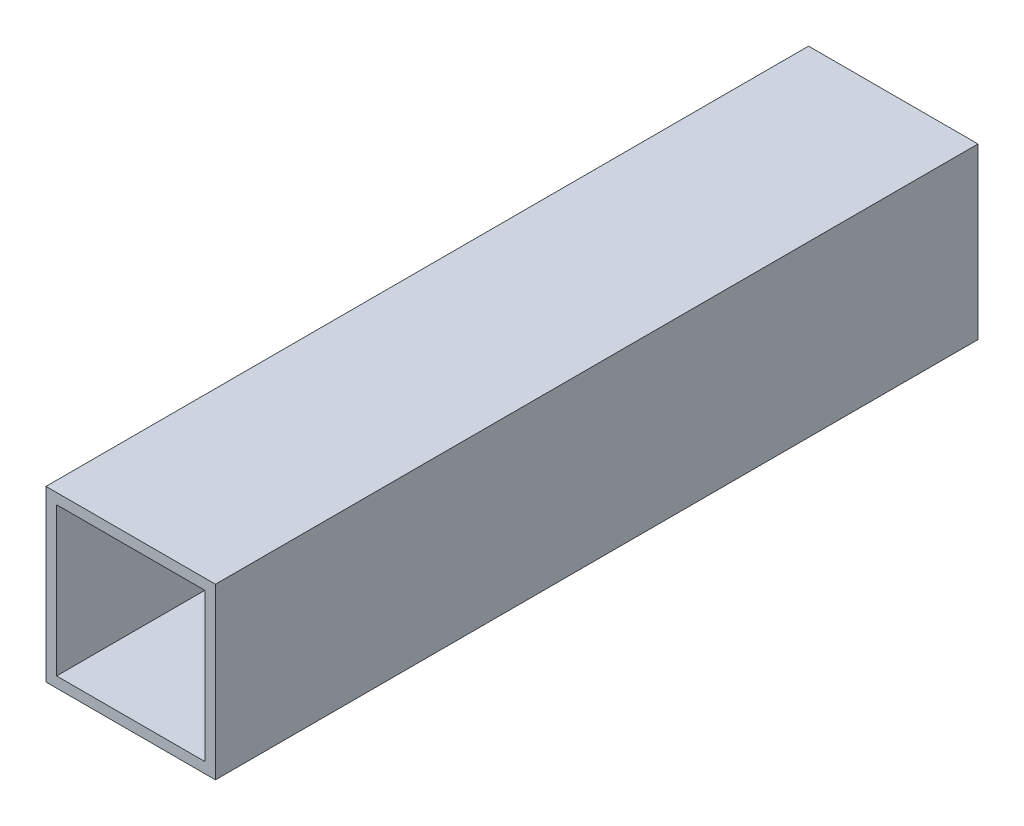
ISO-10303-21;
HEADER;
FILE_DESCRIPTION(('STEP AP214'),'2;1');
FILE_NAME('part.step','',(''),(''),'','','');
FILE_SCHEMA(('AUTOMOTIVE_DESIGN { 1 0 10303 214 1 1 1 1 }'));
ENDSEC;
DATA;
#1=APPLICATION_CONTEXT('core data for automotive mechanical design processes');
#2=APPLICATION_PROTOCOL_DEFINITION('international standard','automotive_design',2000,#1);
#3=PRODUCT_CONTEXT('',#1,'mechanical');
#4=PRODUCT('Part','Part','',(#3));
#5=PRODUCT_RELATED_PRODUCT_CATEGORY('part','',(#4));
#6=PRODUCT_DEFINITION_FORMATION('','',#4);
#7=PRODUCT_DEFINITION_CONTEXT('part definition',#1,'design');
#8=PRODUCT_DEFINITION('design','',#6,#7);
#9=PRODUCT_DEFINITION_SHAPE('','',#8);
#10=(LENGTH_UNIT() NAMED_UNIT(*) SI_UNIT(.MILLI.,.METRE.));
#11=(NAMED_UNIT(*) PLANE_ANGLE_UNIT() SI_UNIT($,.RADIAN.));
#12=(NAMED_UNIT(*) SI_UNIT($,.STERADIAN.) SOLID_ANGLE_UNIT());
#13=UNCERTAINTY_MEASURE_WITH_UNIT(LENGTH_MEASURE(1.E-05),#10,'distance_accuracy_value','');
#14=(GEOMETRIC_REPRESENTATION_CONTEXT(3) GLOBAL_UNCERTAINTY_ASSIGNED_CONTEXT((#13)) GLOBAL_UNIT_ASSIGNED_CONTEXT((#10,
#11,#12)) REPRESENTATION_CONTEXT('',''));
#15=CARTESIAN_POINT('',(0.,0.,0.));
#16=DIRECTION('',(0.,0.,1.));
#17=DIRECTION('',(1.,0.,0.));
#18=AXIS2_PLACEMENT_3D('',#15,#16,#17);
#19=CARTESIAN_POINT('',(0.,0.,228.6));
#20=DIRECTION('',(0.,0.,-1.));
#21=DIRECTION('',(-1.,0.,0.));
#22=AXIS2_PLACEMENT_3D('',#19,#20,#21);
#23=PLANE('',#22);
#24=DIRECTION('',(0.,-1.,0.));
#25=VECTOR('',#24,1.);
#26=CARTESIAN_POINT('',(0.,0.,228.6));
#27=LINE('',#26,#25);
#28=CARTESIAN_POINT('',(0.,50.8,228.6));
#29=VERTEX_POINT('',#28);
#30=CARTESIAN_POINT('',(0.,0.,228.6));
#31=VERTEX_POINT('',#30);
#32=EDGE_CURVE('E137',#29,#31,#27,.T.);
#33=ORIENTED_EDGE('',*,*,#32,.T.);
#34=DIRECTION('',(1.,0.,0.));
#35=VECTOR('',#34,1.);
#36=CARTESIAN_POINT('',(0.,0.,228.6));
#37=LINE('',#36,#35);
#38=CARTESIAN_POINT('',(50.8,0.,228.6));
#39=VERTEX_POINT('',#38);
#40=EDGE_CURVE('E140',#31,#39,#37,.T.);
#41=ORIENTED_EDGE('',*,*,#40,.T.);
#42=DIRECTION('',(0.,1.,0.));
#43=VECTOR('',#42,1.);
#44=CARTESIAN_POINT('',(50.8,0.,228.6));
#45=LINE('',#44,#43);
#46=CARTESIAN_POINT('',(50.8,50.8,228.6));
#47=VERTEX_POINT('',#46);
#48=EDGE_CURVE('E143',#39,#47,#45,.T.);
#49=ORIENTED_EDGE('',*,*,#48,.T.);
#50=DIRECTION('',(-1.,0.,0.));
#51=VECTOR('',#50,1.);
#52=CARTESIAN_POINT('',(0.,50.8,228.6));
#53=LINE('',#52,#51);
#54=EDGE_CURVE('E145',#47,#29,#53,.T.);
#55=ORIENTED_EDGE('',*,*,#54,.T.);
#56=EDGE_LOOP('',(#33,#41,#49,#55));
#57=FACE_BOUND('',#56,.T.);
#58=DIRECTION('',(0.,-1.,0.));
#59=VECTOR('',#58,1.);
#60=CARTESIAN_POINT('',(3.175,3.175,228.6));
#61=LINE('',#60,#59);
#62=CARTESIAN_POINT('',(3.175,47.625,228.6));
#63=VERTEX_POINT('',#62);
#64=CARTESIAN_POINT('',(3.175,3.175,228.6));
#65=VERTEX_POINT('',#64);
#66=EDGE_CURVE('E101',#63,#65,#61,.T.);
#67=ORIENTED_EDGE('',*,*,#66,.F.);
#68=DIRECTION('',(-1.,0.,0.));
#69=VECTOR('',#68,1.);
#70=CARTESIAN_POINT('',(3.175,47.625,228.6));
#71=LINE('',#70,#69);
#72=CARTESIAN_POINT('',(47.625,47.625,228.6));
#73=VERTEX_POINT('',#72);
#74=EDGE_CURVE('E123',#73,#63,#71,.T.);
#75=ORIENTED_EDGE('',*,*,#74,.F.);
#76=DIRECTION('',(0.,1.,0.));
#77=VECTOR('',#76,1.);
#78=CARTESIAN_POINT('',(47.625,3.175,228.6));
#79=LINE('',#78,#77);
#80=CARTESIAN_POINT('',(47.625,3.175,228.6));
#81=VERTEX_POINT('',#80);
#82=EDGE_CURVE('E121',#81,#73,#79,.T.);
#83=ORIENTED_EDGE('',*,*,#82,.F.);
#84=DIRECTION('',(1.,0.,0.));
#85=VECTOR('',#84,1.);
#86=CARTESIAN_POINT('',(3.175,3.175,228.6));
#87=LINE('',#86,#85);
#88=EDGE_CURVE('E109',#65,#81,#87,.T.);
#89=ORIENTED_EDGE('',*,*,#88,.F.);
#90=EDGE_LOOP('',(#67,#75,#83,#89));
#91=FACE_BOUND('',#90,.T.);
#92=ADVANCED_FACE('F36',(#57,#91),#23,.F.);
#93=CARTESIAN_POINT('',(0.,0.,0.));
#94=DIRECTION('',(0.,0.,-1.));
#95=DIRECTION('',(-1.,0.,0.));
#96=AXIS2_PLACEMENT_3D('',#93,#94,#95);
#97=PLANE('',#96);
#98=DIRECTION('',(0.,-1.,0.));
#99=VECTOR('',#98,1.);
#100=CARTESIAN_POINT('',(0.,0.,0.));
#101=LINE('',#100,#99);
#102=CARTESIAN_POINT('',(0.,50.8,0.));
#103=VERTEX_POINT('',#102);
#104=CARTESIAN_POINT('',(0.,0.,0.));
#105=VERTEX_POINT('',#104);
#106=EDGE_CURVE('E117',#103,#105,#101,.T.);
#107=ORIENTED_EDGE('',*,*,#106,.F.);
#108=DIRECTION('',(-1.,0.,0.));
#109=VECTOR('',#108,1.);
#110=CARTESIAN_POINT('',(0.,50.8,0.));
#111=LINE('',#110,#109);
#112=CARTESIAN_POINT('',(50.8,50.8,0.));
#113=VERTEX_POINT('',#112);
#114=EDGE_CURVE('E141',#113,#103,#111,.T.);
#115=ORIENTED_EDGE('',*,*,#114,.F.);
#116=DIRECTION('',(0.,1.,0.));
#117=VECTOR('',#116,1.);
#118=CARTESIAN_POINT('',(50.8,0.,0.));
#119=LINE('',#118,#117);
#120=CARTESIAN_POINT('',(50.8,0.,0.));
#121=VERTEX_POINT('',#120);
#122=EDGE_CURVE('E152',#121,#113,#119,.T.);
#123=ORIENTED_EDGE('',*,*,#122,.F.);
#124=DIRECTION('',(1.,0.,0.));
#125=VECTOR('',#124,1.);
#126=CARTESIAN_POINT('',(0.,0.,0.));
#127=LINE('',#126,#125);
#128=EDGE_CURVE('E150',#105,#121,#127,.T.);
#129=ORIENTED_EDGE('',*,*,#128,.F.);
#130=EDGE_LOOP('',(#107,#115,#123,#129));
#131=FACE_BOUND('',#130,.T.);
#132=DIRECTION('',(-1.,0.,0.));
#133=VECTOR('',#132,1.);
#134=CARTESIAN_POINT('',(3.175,47.625,0.));
#135=LINE('',#134,#133);
#136=CARTESIAN_POINT('',(47.625,47.625,0.));
#137=VERTEX_POINT('',#136);
#138=CARTESIAN_POINT('',(3.175,47.625,0.));
#139=VERTEX_POINT('',#138);
#140=EDGE_CURVE('E110',#137,#139,#135,.T.);
#141=ORIENTED_EDGE('',*,*,#140,.T.);
#142=DIRECTION('',(0.,-1.,0.));
#143=VECTOR('',#142,1.);
#144=CARTESIAN_POINT('',(3.175,3.175,0.));
#145=LINE('',#144,#143);
#146=CARTESIAN_POINT('',(3.175,3.175,0.));
#147=VERTEX_POINT('',#146);
#148=EDGE_CURVE('E59',#139,#147,#145,.T.);
#149=ORIENTED_EDGE('',*,*,#148,.T.);
#150=DIRECTION('',(1.,0.,0.));
#151=VECTOR('',#150,1.);
#152=CARTESIAN_POINT('',(3.175,3.175,0.));
#153=LINE('',#152,#151);
#154=CARTESIAN_POINT('',(47.625,3.175,0.));
#155=VERTEX_POINT('',#154);
#156=EDGE_CURVE('E116',#147,#155,#153,.T.);
#157=ORIENTED_EDGE('',*,*,#156,.T.);
#158=DIRECTION('',(0.,1.,0.));
#159=VECTOR('',#158,1.);
#160=CARTESIAN_POINT('',(47.625,3.175,0.));
#161=LINE('',#160,#159);
#162=EDGE_CURVE('E129',#155,#137,#161,.T.);
#163=ORIENTED_EDGE('',*,*,#162,.T.);
#164=EDGE_LOOP('',(#141,#149,#157,#163));
#165=FACE_BOUND('',#164,.T.);
#166=ADVANCED_FACE('F170',(#131,#165),#97,.T.);
#167=CARTESIAN_POINT('',(0.,0.,228.6));
#168=DIRECTION('',(1.,0.,0.));
#169=DIRECTION('',(0.,0.,-1.));
#170=AXIS2_PLACEMENT_3D('',#167,#168,#169);
#171=PLANE('',#170);
#172=ORIENTED_EDGE('',*,*,#106,.T.);
#173=DIRECTION('',(0.,0.,-1.));
#174=VECTOR('',#173,1.);
#175=CARTESIAN_POINT('',(0.,0.,228.6));
#176=LINE('',#175,#174);
#177=EDGE_CURVE('E11',#31,#105,#176,.T.);
#178=ORIENTED_EDGE('',*,*,#177,.F.);
#179=ORIENTED_EDGE('',*,*,#32,.F.);
#180=DIRECTION('',(0.,0.,-1.));
#181=VECTOR('',#180,1.);
#182=CARTESIAN_POINT('',(0.,50.8,228.6));
#183=LINE('',#182,#181);
#184=EDGE_CURVE('E147',#29,#103,#183,.T.);
#185=ORIENTED_EDGE('',*,*,#184,.T.);
#186=EDGE_LOOP('',(#172,#178,#179,#185));
#187=FACE_BOUND('',#186,.T.);
#188=ADVANCED_FACE('F38',(#187),#171,.F.);
#189=CARTESIAN_POINT('',(0.,0.,228.6));
#190=DIRECTION('',(0.,1.,0.));
#191=DIRECTION('',(0.,0.,1.));
#192=AXIS2_PLACEMENT_3D('',#189,#190,#191);
#193=PLANE('',#192);
#194=ORIENTED_EDGE('',*,*,#128,.T.);
#195=DIRECTION('',(0.,0.,-1.));
#196=VECTOR('',#195,1.);
#197=CARTESIAN_POINT('',(50.8,0.,228.6));
#198=LINE('',#197,#196);
#199=EDGE_CURVE('E44',#39,#121,#198,.T.);
#200=ORIENTED_EDGE('',*,*,#199,.F.);
#201=ORIENTED_EDGE('',*,*,#40,.F.);
#202=ORIENTED_EDGE('',*,*,#177,.T.);
#203=EDGE_LOOP('',(#194,#200,#201,#202));
#204=FACE_BOUND('',#203,.T.);
#205=ADVANCED_FACE('F180',(#204),#193,.F.);
#206=CARTESIAN_POINT('',(50.8,0.,228.6));
#207=DIRECTION('',(-1.,0.,0.));
#208=DIRECTION('',(0.,0.,1.));
#209=AXIS2_PLACEMENT_3D('',#206,#207,#208);
#210=PLANE('',#209);
#211=ORIENTED_EDGE('',*,*,#122,.T.);
#212=DIRECTION('',(0.,0.,-1.));
#213=VECTOR('',#212,1.);
#214=CARTESIAN_POINT('',(50.8,50.8,228.6));
#215=LINE('',#214,#213);
#216=EDGE_CURVE('E157',#47,#113,#215,.T.);
#217=ORIENTED_EDGE('',*,*,#216,.F.);
#218=ORIENTED_EDGE('',*,*,#48,.F.);
#219=ORIENTED_EDGE('',*,*,#199,.T.);
#220=EDGE_LOOP('',(#211,#217,#218,#219));
#221=FACE_BOUND('',#220,.T.);
#222=ADVANCED_FACE('F164',(#221),#210,.F.);
#223=CARTESIAN_POINT('',(0.,50.8,228.6));
#224=DIRECTION('',(0.,-1.,0.));
#225=DIRECTION('',(0.,0.,-1.));
#226=AXIS2_PLACEMENT_3D('',#223,#224,#225);
#227=PLANE('',#226);
#228=ORIENTED_EDGE('',*,*,#114,.T.);
#229=ORIENTED_EDGE('',*,*,#184,.F.);
#230=ORIENTED_EDGE('',*,*,#54,.F.);
#231=ORIENTED_EDGE('',*,*,#216,.T.);
#232=EDGE_LOOP('',(#228,#229,#230,#231));
#233=FACE_BOUND('',#232,.T.);
#234=ADVANCED_FACE('F174',(#233),#227,.F.);
#235=CARTESIAN_POINT('',(3.175,3.175,228.6));
#236=DIRECTION('',(1.,0.,0.));
#237=DIRECTION('',(0.,0.,-1.));
#238=AXIS2_PLACEMENT_3D('',#235,#236,#237);
#239=PLANE('',#238);
#240=ORIENTED_EDGE('',*,*,#148,.F.);
#241=DIRECTION('',(0.,0.,-1.));
#242=VECTOR('',#241,1.);
#243=CARTESIAN_POINT('',(3.175,47.625,228.6));
#244=LINE('',#243,#242);
#245=EDGE_CURVE('E105',#63,#139,#244,.T.);
#246=ORIENTED_EDGE('',*,*,#245,.F.);
#247=ORIENTED_EDGE('',*,*,#66,.T.);
#248=DIRECTION('',(0.,0.,-1.));
#249=VECTOR('',#248,1.);
#250=CARTESIAN_POINT('',(3.175,3.175,228.6));
#251=LINE('',#250,#249);
#252=EDGE_CURVE('E104',#65,#147,#251,.T.);
#253=ORIENTED_EDGE('',*,*,#252,.T.);
#254=EDGE_LOOP('',(#240,#246,#247,#253));
#255=FACE_BOUND('',#254,.T.);
#256=ADVANCED_FACE('F103',(#255),#239,.T.);
#257=CARTESIAN_POINT('',(3.175,3.175,228.6));
#258=DIRECTION('',(0.,1.,0.));
#259=DIRECTION('',(0.,0.,1.));
#260=AXIS2_PLACEMENT_3D('',#257,#258,#259);
#261=PLANE('',#260);
#262=ORIENTED_EDGE('',*,*,#156,.F.);
#263=ORIENTED_EDGE('',*,*,#252,.F.);
#264=ORIENTED_EDGE('',*,*,#88,.T.);
#265=DIRECTION('',(0.,0.,-1.));
#266=VECTOR('',#265,1.);
#267=CARTESIAN_POINT('',(47.625,3.175,228.6));
#268=LINE('',#267,#266);
#269=EDGE_CURVE('E118',#81,#155,#268,.T.);
#270=ORIENTED_EDGE('',*,*,#269,.T.);
#271=EDGE_LOOP('',(#262,#263,#264,#270));
#272=FACE_BOUND('',#271,.T.);
#273=ADVANCED_FACE('F113',(#272),#261,.T.);
#274=CARTESIAN_POINT('',(47.625,3.175,228.6));
#275=DIRECTION('',(-1.,0.,0.));
#276=DIRECTION('',(0.,0.,1.));
#277=AXIS2_PLACEMENT_3D('',#274,#275,#276);
#278=PLANE('',#277);
#279=ORIENTED_EDGE('',*,*,#162,.F.);
#280=ORIENTED_EDGE('',*,*,#269,.F.);
#281=ORIENTED_EDGE('',*,*,#82,.T.);
#282=DIRECTION('',(0.,0.,-1.));
#283=VECTOR('',#282,1.);
#284=CARTESIAN_POINT('',(47.625,47.625,228.6));
#285=LINE('',#284,#283);
#286=EDGE_CURVE('E51',#73,#137,#285,.T.);
#287=ORIENTED_EDGE('',*,*,#286,.T.);
#288=EDGE_LOOP('',(#279,#280,#281,#287));
#289=FACE_BOUND('',#288,.T.);
#290=ADVANCED_FACE('F203',(#289),#278,.T.);
#291=CARTESIAN_POINT('',(3.175,47.625,228.6));
#292=DIRECTION('',(0.,-1.,0.));
#293=DIRECTION('',(0.,0.,-1.));
#294=AXIS2_PLACEMENT_3D('',#291,#292,#293);
#295=PLANE('',#294);
#296=ORIENTED_EDGE('',*,*,#140,.F.);
#297=ORIENTED_EDGE('',*,*,#286,.F.);
#298=ORIENTED_EDGE('',*,*,#74,.T.);
#299=ORIENTED_EDGE('',*,*,#245,.T.);
#300=EDGE_LOOP('',(#296,#297,#298,#299));
#301=FACE_BOUND('',#300,.T.);
#302=ADVANCED_FACE('F207',(#301),#295,.T.);
#303=CLOSED_SHELL('',(#92,#166,#188,#205,#222,#234,#256,#273,#290,#302));
#304=MANIFOLD_SOLID_BREP('B2',#303);
#305=ADVANCED_BREP_SHAPE_REPRESENTATION('',(#18,#304),#14);
#306=SHAPE_DEFINITION_REPRESENTATION(#9,#305);
ENDSEC;
END-ISO-10303-21;
